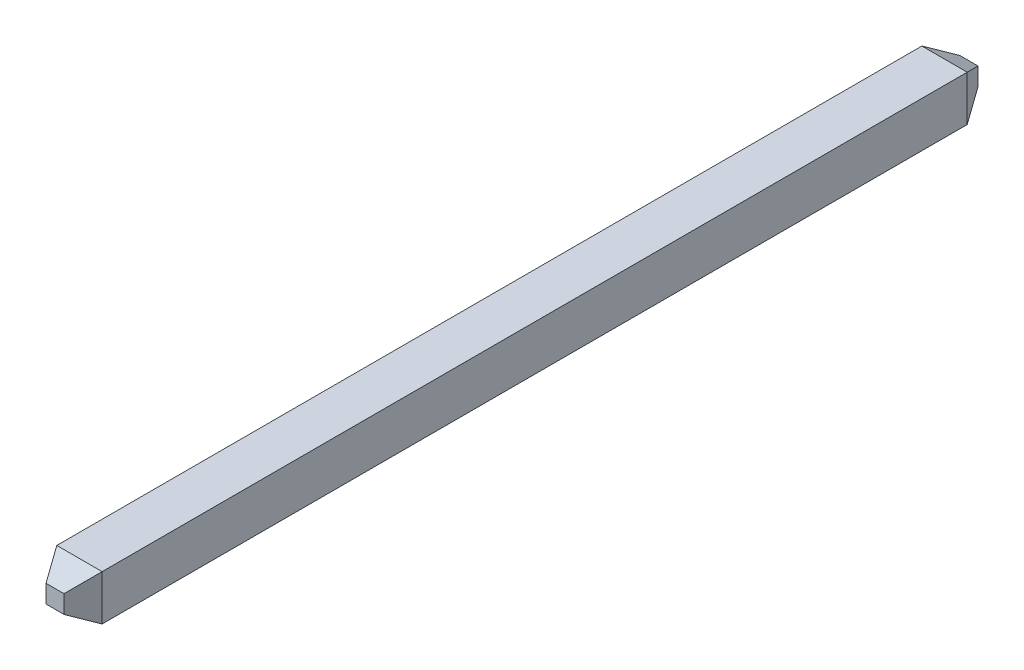
ISO-10303-21;
HEADER;
FILE_DESCRIPTION(('STEP AP214'),'2;1');
FILE_NAME('part.step','',(''),(''),'','','');
FILE_SCHEMA(('AUTOMOTIVE_DESIGN { 1 0 10303 214 1 1 1 1 }'));
ENDSEC;
DATA;
#1=APPLICATION_CONTEXT('core data for automotive mechanical design processes');
#2=APPLICATION_PROTOCOL_DEFINITION('international standard','automotive_design',2000,#1);
#3=PRODUCT_CONTEXT('',#1,'mechanical');
#4=PRODUCT('Part','Part','',(#3));
#5=PRODUCT_RELATED_PRODUCT_CATEGORY('part','',(#4));
#6=PRODUCT_DEFINITION_FORMATION('','',#4);
#7=PRODUCT_DEFINITION_CONTEXT('part definition',#1,'design');
#8=PRODUCT_DEFINITION('design','',#6,#7);
#9=PRODUCT_DEFINITION_SHAPE('','',#8);
#10=(LENGTH_UNIT() NAMED_UNIT(*) SI_UNIT(.MILLI.,.METRE.));
#11=(NAMED_UNIT(*) PLANE_ANGLE_UNIT() SI_UNIT($,.RADIAN.));
#12=(NAMED_UNIT(*) SI_UNIT($,.STERADIAN.) SOLID_ANGLE_UNIT());
#13=UNCERTAINTY_MEASURE_WITH_UNIT(LENGTH_MEASURE(1.E-05),#10,'distance_accuracy_value','');
#14=(GEOMETRIC_REPRESENTATION_CONTEXT(3) GLOBAL_UNCERTAINTY_ASSIGNED_CONTEXT((#13)) GLOBAL_UNIT_ASSIGNED_CONTEXT((#10,
#11,#12)) REPRESENTATION_CONTEXT('',''));
#15=CARTESIAN_POINT('',(0.,0.,0.));
#16=DIRECTION('',(0.,0.,1.));
#17=DIRECTION('',(1.,0.,0.));
#18=AXIS2_PLACEMENT_3D('',#15,#16,#17);
#19=CARTESIAN_POINT('',(10.2801151004192,0.945,-3.20872569516347));
#20=DIRECTION('',(0.872569516347454,0.,-0.48848995807608));
#21=DIRECTION('',(-0.48848995807608,0.,-0.872569516347454));
#22=AXIS2_PLACEMENT_3D('',#19,#20,#21);
#23=PLANE('',#22);
#24=DIRECTION('',(0.,1.,0.));
#25=VECTOR('',#24,1.);
#26=CARTESIAN_POINT('',(10.4753418566447,0.944999999999999,-2.86000017186176));
#27=LINE('',#26,#25);
#28=CARTESIAN_POINT('',(10.4753418566326,0.954999975315066,-2.85999984563026));
#29=VERTEX_POINT('',#28);
#30=CARTESIAN_POINT('',(10.4753420172919,1.58500016035866,-2.85999988490429));
#31=VERTEX_POINT('',#30);
#32=EDGE_CURVE('E118',#29,#31,#27,.T.);
#33=ORIENTED_EDGE('',*,*,#32,.F.);
#34=DIRECTION('',(0.439072617568685,-0.438284036988102,0.784297353956263));
#35=VECTOR('',#34,1.);
#36=CARTESIAN_POINT('',(10.285,1.145,-3.2));
#37=LINE('',#36,#35);
#38=CARTESIAN_POINT('',(10.285,1.145,-3.2));
#39=VERTEX_POINT('',#38);
#40=EDGE_CURVE('E116',#39,#29,#37,.T.);
#41=ORIENTED_EDGE('',*,*,#40,.F.);
#42=DIRECTION('',(0.,1.,0.));
#43=VECTOR('',#42,1.);
#44=CARTESIAN_POINT('',(10.285,1.135,-3.2));
#45=LINE('',#44,#43);
#46=CARTESIAN_POINT('',(10.285,1.395,-3.2));
#47=VERTEX_POINT('',#46);
#48=EDGE_CURVE('E79',#47,#39,#45,.F.);
#49=ORIENTED_EDGE('',*,*,#48,.F.);
#50=DIRECTION('',(-0.439072617568685,-0.438284036988102,-0.784297353956263));
#51=VECTOR('',#50,1.);
#52=CARTESIAN_POINT('',(10.4753418566447,1.585,-2.86000017186176));
#53=LINE('',#52,#51);
#54=EDGE_CURVE('E110',#31,#47,#53,.T.);
#55=ORIENTED_EDGE('',*,*,#54,.F.);
#56=EDGE_LOOP('',(#33,#41,#49,#55));
#57=FACE_BOUND('',#56,.T.);
#58=ADVANCED_FACE('F17',(#57),#23,.T.);
#59=CARTESIAN_POINT('',(10.2803670281429,0.945,9.50441734607014));
#60=DIRECTION('',(0.873317045523296,0.,0.487152273933378));
#61=DIRECTION('',(0.487152273933378,0.,-0.873317045523296));
#62=AXIS2_PLACEMENT_3D('',#59,#60,#61);
#63=PLANE('',#62);
#64=DIRECTION('',(-0.437799852400754,0.438586917260879,0.784839349959899));
#65=VECTOR('',#64,1.);
#66=CARTESIAN_POINT('',(10.4748978995516,0.954999686828512,9.15568378706481));
#67=LINE('',#66,#65);
#68=CARTESIAN_POINT('',(10.4748976545499,0.954999891076842,9.155683688451));
#69=VERTEX_POINT('',#68);
#70=CARTESIAN_POINT('',(10.2852385508823,1.145,9.4956841756149));
#71=VERTEX_POINT('',#70);
#72=EDGE_CURVE('E122',#69,#71,#67,.T.);
#73=ORIENTED_EDGE('',*,*,#72,.F.);
#74=DIRECTION('',(0.,1.,0.));
#75=VECTOR('',#74,1.);
#76=CARTESIAN_POINT('',(10.4748985390065,0.944999999999999,9.15568372243695));
#77=LINE('',#76,#75);
#78=CARTESIAN_POINT('',(10.4748976528046,1.5850001770326,9.15568371270384));
#79=VERTEX_POINT('',#78);
#80=EDGE_CURVE('E89',#79,#69,#77,.F.);
#81=ORIENTED_EDGE('',*,*,#80,.F.);
#82=DIRECTION('',(0.437799852400943,0.438586917260834,-0.784839349959818));
#83=VECTOR('',#82,1.);
#84=CARTESIAN_POINT('',(10.2852385508823,1.395,9.49568417561491));
#85=LINE('',#84,#83);
#86=CARTESIAN_POINT('',(10.2852385508823,1.395,9.4956841756149));
#87=VERTEX_POINT('',#86);
#88=EDGE_CURVE('E84',#87,#79,#85,.T.);
#89=ORIENTED_EDGE('',*,*,#88,.F.);
#90=DIRECTION('',(0.,1.,0.));
#91=VECTOR('',#90,1.);
#92=CARTESIAN_POINT('',(10.2852385508823,1.405,9.49568417561491));
#93=LINE('',#92,#91);
#94=EDGE_CURVE('E20',#71,#87,#93,.T.);
#95=ORIENTED_EDGE('',*,*,#94,.F.);
#96=EDGE_LOOP('',(#73,#81,#89,#95));
#97=FACE_BOUND('',#96,.T.);
#98=ADVANCED_FACE('F86',(#97),#63,.T.);
#99=CARTESIAN_POINT('',(10.0252385508823,1.405,9.49568417561491));
#100=DIRECTION('',(0.,0.,1.));
#101=DIRECTION('',(1.,0.,0.));
#102=AXIS2_PLACEMENT_3D('',#99,#100,#101);
#103=PLANE('',#102);
#104=DIRECTION('',(1.,0.,0.));
#105=VECTOR('',#104,1.);
#106=CARTESIAN_POINT('',(9.8348966942376,1.395,9.49568417561491));
#107=LINE('',#106,#105);
#108=CARTESIAN_POINT('',(10.0352385508823,1.395,9.49568417561492));
#109=VERTEX_POINT('',#108);
#110=EDGE_CURVE('E93',#109,#87,#107,.T.);
#111=ORIENTED_EDGE('',*,*,#110,.F.);
#112=DIRECTION('',(0.,1.,0.));
#113=VECTOR('',#112,1.);
#114=CARTESIAN_POINT('',(10.0352385508823,0.945,9.49568417561494));
#115=LINE('',#114,#113);
#116=CARTESIAN_POINT('',(10.0352385508823,1.145,9.49568417561492));
#117=VERTEX_POINT('',#116);
#118=EDGE_CURVE('E129',#117,#109,#115,.T.);
#119=ORIENTED_EDGE('',*,*,#118,.F.);
#120=DIRECTION('',(1.,0.,0.));
#121=VECTOR('',#120,1.);
#122=CARTESIAN_POINT('',(9.8348966942376,1.145,9.49568417561491));
#123=LINE('',#122,#121);
#124=EDGE_CURVE('E98',#71,#117,#123,.F.);
#125=ORIENTED_EDGE('',*,*,#124,.F.);
#126=ORIENTED_EDGE('',*,*,#94,.T.);
#127=EDGE_LOOP('',(#111,#119,#125,#126));
#128=FACE_BOUND('',#127,.T.);
#129=ADVANCED_FACE('F95',(#128),#103,.T.);
#130=CARTESIAN_POINT('',(9.8348966942376,1.39012178454432,9.50441360938624));
#131=DIRECTION('',(0.,0.872943377132664,0.487821545567864));
#132=DIRECTION('',(0.,-0.487821545567864,0.872943377132664));
#133=AXIS2_PLACEMENT_3D('',#130,#131,#132);
#134=PLANE('',#133);
#135=DIRECTION('',(-0.439072459537937,0.438284700441644,-0.784297071672517));
#136=VECTOR('',#135,1.);
#137=CARTESIAN_POINT('',(10.0352385508823,1.395,9.49568417561494));
#138=LINE('',#137,#136);
#139=CARTESIAN_POINT('',(9.84489750370277,1.58500008247258,9.15568447138296));
#140=VERTEX_POINT('',#139);
#141=EDGE_CURVE('E102',#109,#140,#138,.T.);
#142=ORIENTED_EDGE('',*,*,#141,.F.);
#143=ORIENTED_EDGE('',*,*,#110,.T.);
#144=ORIENTED_EDGE('',*,*,#88,.T.);
#145=DIRECTION('',(1.,0.,0.));
#146=VECTOR('',#145,1.);
#147=CARTESIAN_POINT('',(10.1600665893728,1.585,9.15568497320465));
#148=LINE('',#147,#146);
#149=EDGE_CURVE('E131',#140,#79,#148,.T.);
#150=ORIENTED_EDGE('',*,*,#149,.F.);
#151=EDGE_LOOP('',(#142,#143,#144,#150));
#152=FACE_BOUND('',#151,.T.);
#153=ADVANCED_FACE('F100',(#152),#134,.T.);
#154=CARTESIAN_POINT('',(10.025,1.135,-3.2));
#155=DIRECTION('',(0.,0.,-1.));
#156=DIRECTION('',(-1.,0.,0.));
#157=AXIS2_PLACEMENT_3D('',#154,#155,#156);
#158=PLANE('',#157);
#159=ORIENTED_EDGE('',*,*,#48,.T.);
#160=DIRECTION('',(1.,0.,0.));
#161=VECTOR('',#160,1.);
#162=CARTESIAN_POINT('',(9.83534185664468,1.145,-3.2));
#163=LINE('',#162,#161);
#164=CARTESIAN_POINT('',(10.035,1.145,-3.2));
#165=VERTEX_POINT('',#164);
#166=EDGE_CURVE('E113',#165,#39,#163,.T.);
#167=ORIENTED_EDGE('',*,*,#166,.F.);
#168=DIRECTION('',(0.,1.,0.));
#169=VECTOR('',#168,1.);
#170=CARTESIAN_POINT('',(10.035,0.945,-3.20000000000001));
#171=LINE('',#170,#169);
#172=CARTESIAN_POINT('',(10.035,1.395,-3.2));
#173=VERTEX_POINT('',#172);
#174=EDGE_CURVE('E140',#173,#165,#171,.F.);
#175=ORIENTED_EDGE('',*,*,#174,.F.);
#176=DIRECTION('',(1.,0.,0.));
#177=VECTOR('',#176,1.);
#178=CARTESIAN_POINT('',(9.83534185664468,1.395,-3.2));
#179=LINE('',#178,#177);
#180=EDGE_CURVE('E105',#47,#173,#179,.F.);
#181=ORIENTED_EDGE('',*,*,#180,.F.);
#182=EDGE_LOOP('',(#159,#167,#175,#181));
#183=FACE_BOUND('',#182,.T.);
#184=ADVANCED_FACE('F184',(#183),#158,.T.);
#185=CARTESIAN_POINT('',(9.83534185664468,1.58987821545568,-2.85127073809043));
#186=DIRECTION('',(0.,0.872943377132663,-0.487821545567865));
#187=DIRECTION('',(0.,0.487821545567865,0.872943377132663));
#188=AXIS2_PLACEMENT_3D('',#185,#186,#187);
#189=PLANE('',#188);
#190=DIRECTION('',(1.,0.,0.));
#191=VECTOR('',#190,1.);
#192=CARTESIAN_POINT('',(10.1600665893728,1.585,-2.86000017186176));
#193=LINE('',#192,#191);
#194=CARTESIAN_POINT('',(9.84534144768618,1.5850007068091,-2.8599984305592));
#195=VERTEX_POINT('',#194);
#196=EDGE_CURVE('E137',#31,#195,#193,.F.);
#197=ORIENTED_EDGE('',*,*,#196,.F.);
#198=ORIENTED_EDGE('',*,*,#54,.T.);
#199=ORIENTED_EDGE('',*,*,#180,.T.);
#200=DIRECTION('',(0.437798396819592,-0.438586429089656,-0.784840434713057));
#201=VECTOR('',#200,1.);
#202=CARTESIAN_POINT('',(9.84534066407529,1.58500072063078,-2.85999803394472));
#203=LINE('',#202,#201);
#204=EDGE_CURVE('E145',#195,#173,#203,.T.);
#205=ORIENTED_EDGE('',*,*,#204,.F.);
#206=EDGE_LOOP('',(#197,#198,#199,#205));
#207=FACE_BOUND('',#206,.T.);
#208=ADVANCED_FACE('F182',(#207),#189,.T.);
#209=CARTESIAN_POINT('',(9.83534185664468,1.14987821545568,-3.20872943377133));
#210=DIRECTION('',(0.,-0.872943377132663,-0.487821545567865));
#211=DIRECTION('',(0.,0.487821545567865,-0.872943377132663));
#212=AXIS2_PLACEMENT_3D('',#209,#210,#211);
#213=PLANE('',#212);
#214=ORIENTED_EDGE('',*,*,#166,.T.);
#215=ORIENTED_EDGE('',*,*,#40,.T.);
#216=DIRECTION('',(1.,0.,0.));
#217=VECTOR('',#216,1.);
#218=CARTESIAN_POINT('',(9.83494834685547,0.955,-2.85999756200983));
#219=LINE('',#218,#217);
#220=CARTESIAN_POINT('',(9.84534198218487,0.954999729763457,-2.85999898491792));
#221=VERTEX_POINT('',#220);
#222=EDGE_CURVE('E35',#221,#29,#219,.T.);
#223=ORIENTED_EDGE('',*,*,#222,.F.);
#224=DIRECTION('',(-0.43779839681959,-0.438586429089667,0.784840434713051));
#225=VECTOR('',#224,1.);
#226=CARTESIAN_POINT('',(10.035,1.145,-3.20000000000001));
#227=LINE('',#226,#225);
#228=EDGE_CURVE('E143',#165,#221,#227,.T.);
#229=ORIENTED_EDGE('',*,*,#228,.F.);
#230=EDGE_LOOP('',(#214,#215,#223,#229));
#231=FACE_BOUND('',#230,.T.);
#232=ADVANCED_FACE('F185',(#231),#213,.T.);
#233=CARTESIAN_POINT('',(10.4753463082688,0.944999999999999,-2.98065701705514));
#234=DIRECTION('',(0.999999999319383,0.,3.68949151672057E-05));
#235=DIRECTION('',(3.68949151672057E-05,0.,-0.999999999319383));
#236=AXIS2_PLACEMENT_3D('',#233,#234,#235);
#237=PLANE('',#236);
#238=DIRECTION('',(3.69481335064168E-05,0.,-0.999999999317418));
#239=VECTOR('',#238,1.);
#240=CARTESIAN_POINT('',(10.4748978995517,1.585,9.15568372241336));
#241=LINE('',#240,#239);
#242=EDGE_CURVE('E134',#79,#31,#241,.T.);
#243=ORIENTED_EDGE('',*,*,#242,.F.);
#244=ORIENTED_EDGE('',*,*,#80,.T.);
#245=DIRECTION('',(-3.69481335147904E-05,0.,0.999999999317418));
#246=VECTOR('',#245,1.);
#247=CARTESIAN_POINT('',(10.4753418566447,0.955,-2.86000017186176));
#248=LINE('',#247,#246);
#249=EDGE_CURVE('E149',#29,#69,#248,.T.);
#250=ORIENTED_EDGE('',*,*,#249,.F.);
#251=ORIENTED_EDGE('',*,*,#32,.T.);
#252=EDGE_LOOP('',(#243,#244,#250,#251));
#253=FACE_BOUND('',#252,.T.);
#254=ADVANCED_FACE('F187',(#253),#237,.T.);
#255=CARTESIAN_POINT('',(9.8348966942376,0.950121784544321,9.14695491370534));
#256=DIRECTION('',(0.,-0.872943377132664,0.487821545567865));
#257=DIRECTION('',(0.,-0.487821545567865,-0.872943377132664));
#258=AXIS2_PLACEMENT_3D('',#255,#256,#257);
#259=PLANE('',#258);
#260=ORIENTED_EDGE('',*,*,#124,.T.);
#261=DIRECTION('',(0.439072459537936,0.438284700441646,0.784297071672516));
#262=VECTOR('',#261,1.);
#263=CARTESIAN_POINT('',(9.84489724886551,0.955000197635099,9.15568533818577));
#264=LINE('',#263,#262);
#265=CARTESIAN_POINT('',(9.84489781760236,0.955000116075711,9.15568487573229));
#266=VERTEX_POINT('',#265);
#267=EDGE_CURVE('E126',#266,#117,#264,.T.);
#268=ORIENTED_EDGE('',*,*,#267,.F.);
#269=DIRECTION('',(1.,0.,0.));
#270=VECTOR('',#269,1.);
#271=CARTESIAN_POINT('',(9.83494834685547,0.955,9.15568372241336));
#272=LINE('',#271,#270);
#273=EDGE_CURVE('E152',#69,#266,#272,.F.);
#274=ORIENTED_EDGE('',*,*,#273,.F.);
#275=ORIENTED_EDGE('',*,*,#72,.T.);
#276=EDGE_LOOP('',(#260,#268,#274,#275));
#277=FACE_BOUND('',#276,.T.);
#278=ADVANCED_FACE('F174',(#277),#259,.T.);
#279=CARTESIAN_POINT('',(10.040123450463,0.945,9.50440987077839));
#280=DIRECTION('',(-0.872569516347452,0.,0.488489958076083));
#281=DIRECTION('',(0.488489958076083,0.,0.872569516347452));
#282=AXIS2_PLACEMENT_3D('',#279,#280,#281);
#283=PLANE('',#282);
#284=ORIENTED_EDGE('',*,*,#267,.T.);
#285=ORIENTED_EDGE('',*,*,#118,.T.);
#286=ORIENTED_EDGE('',*,*,#141,.T.);
#287=DIRECTION('',(0.,1.,0.));
#288=VECTOR('',#287,1.);
#289=CARTESIAN_POINT('',(9.84489853896027,0.945,9.15568497322819));
#290=LINE('',#289,#288);
#291=EDGE_CURVE('E155',#266,#140,#290,.T.);
#292=ORIENTED_EDGE('',*,*,#291,.F.);
#293=EDGE_LOOP('',(#284,#285,#286,#292));
#294=FACE_BOUND('',#293,.T.);
#295=ADVANCED_FACE('F177',(#294),#283,.T.);
#296=CARTESIAN_POINT('',(10.1600665893728,1.585,9.32634470275115));
#297=DIRECTION('',(0.,1.,0.));
#298=DIRECTION('',(0.,0.,1.));
#299=AXIS2_PLACEMENT_3D('',#296,#297,#298);
#300=PLANE('',#299);
#301=ORIENTED_EDGE('',*,*,#196,.T.);
#302=DIRECTION('',(-3.68949151673762E-05,0.,0.999999999319383));
#303=VECTOR('',#302,1.);
#304=CARTESIAN_POINT('',(9.84489224235438,1.5849998023649,9.32634821671993));
#305=LINE('',#304,#303);
#306=EDGE_CURVE('E158',#140,#195,#305,.F.);
#307=ORIENTED_EDGE('',*,*,#306,.F.);
#308=ORIENTED_EDGE('',*,*,#149,.T.);
#309=ORIENTED_EDGE('',*,*,#242,.T.);
#310=EDGE_LOOP('',(#301,#307,#308,#309));
#311=FACE_BOUND('',#310,.T.);
#312=ADVANCED_FACE('F179',(#311),#300,.T.);
#313=CARTESIAN_POINT('',(10.0398715227393,0.945,-3.20873317045523));
#314=DIRECTION('',(-0.873317045523299,0.,-0.487152273933373));
#315=DIRECTION('',(-0.487152273933373,0.,0.873317045523299));
#316=AXIS2_PLACEMENT_3D('',#313,#314,#315);
#317=PLANE('',#316);
#318=DIRECTION('',(0.,1.,0.));
#319=VECTOR('',#318,1.);
#320=CARTESIAN_POINT('',(9.84534185654839,0.945,-2.85999756199704));
#321=LINE('',#320,#319);
#322=EDGE_CURVE('E26',#195,#221,#321,.F.);
#323=ORIENTED_EDGE('',*,*,#322,.F.);
#324=ORIENTED_EDGE('',*,*,#204,.T.);
#325=ORIENTED_EDGE('',*,*,#174,.T.);
#326=ORIENTED_EDGE('',*,*,#228,.T.);
#327=EDGE_LOOP('',(#323,#324,#325,#326));
#328=FACE_BOUND('',#327,.T.);
#329=ADVANCED_FACE('F168',(#328),#317,.T.);
#330=CARTESIAN_POINT('',(9.83494834685547,0.955,3.17284922525592));
#331=DIRECTION('',(0.,-1.,0.));
#332=DIRECTION('',(0.,0.,-1.));
#333=AXIS2_PLACEMENT_3D('',#330,#331,#332);
#334=PLANE('',#333);
#335=ORIENTED_EDGE('',*,*,#249,.T.);
#336=ORIENTED_EDGE('',*,*,#273,.T.);
#337=DIRECTION('',(-3.68949151673762E-05,0.,0.999999999319383));
#338=VECTOR('',#337,1.);
#339=CARTESIAN_POINT('',(9.84489224235438,0.954999279369218,9.32634821671993));
#340=LINE('',#339,#338);
#341=EDGE_CURVE('E11',#221,#266,#340,.T.);
#342=ORIENTED_EDGE('',*,*,#341,.F.);
#343=ORIENTED_EDGE('',*,*,#222,.T.);
#344=EDGE_LOOP('',(#335,#336,#342,#343));
#345=FACE_BOUND('',#344,.T.);
#346=ADVANCED_FACE('F170',(#345),#334,.T.);
#347=CARTESIAN_POINT('',(9.84489224235438,0.945,9.32634821671993));
#348=DIRECTION('',(-0.999999999319383,0.,-3.68949151673762E-05));
#349=DIRECTION('',(-3.68949151673762E-05,0.,0.999999999319383));
#350=AXIS2_PLACEMENT_3D('',#347,#348,#349);
#351=PLANE('',#350);
#352=ORIENTED_EDGE('',*,*,#322,.T.);
#353=ORIENTED_EDGE('',*,*,#341,.T.);
#354=ORIENTED_EDGE('',*,*,#291,.T.);
#355=ORIENTED_EDGE('',*,*,#306,.T.);
#356=EDGE_LOOP('',(#352,#353,#354,#355));
#357=FACE_BOUND('',#356,.T.);
#358=ADVANCED_FACE('F164',(#357),#351,.T.);
#359=CLOSED_SHELL('',(#58,#98,#129,#153,#184,#208,#232,#254,#278,#295,#312,#329,#346,#358));
#360=MANIFOLD_SOLID_BREP('B1',#359);
#361=ADVANCED_BREP_SHAPE_REPRESENTATION('',(#18,#360),#14);
#362=SHAPE_DEFINITION_REPRESENTATION(#9,#361);
ENDSEC;
END-ISO-10303-21;
